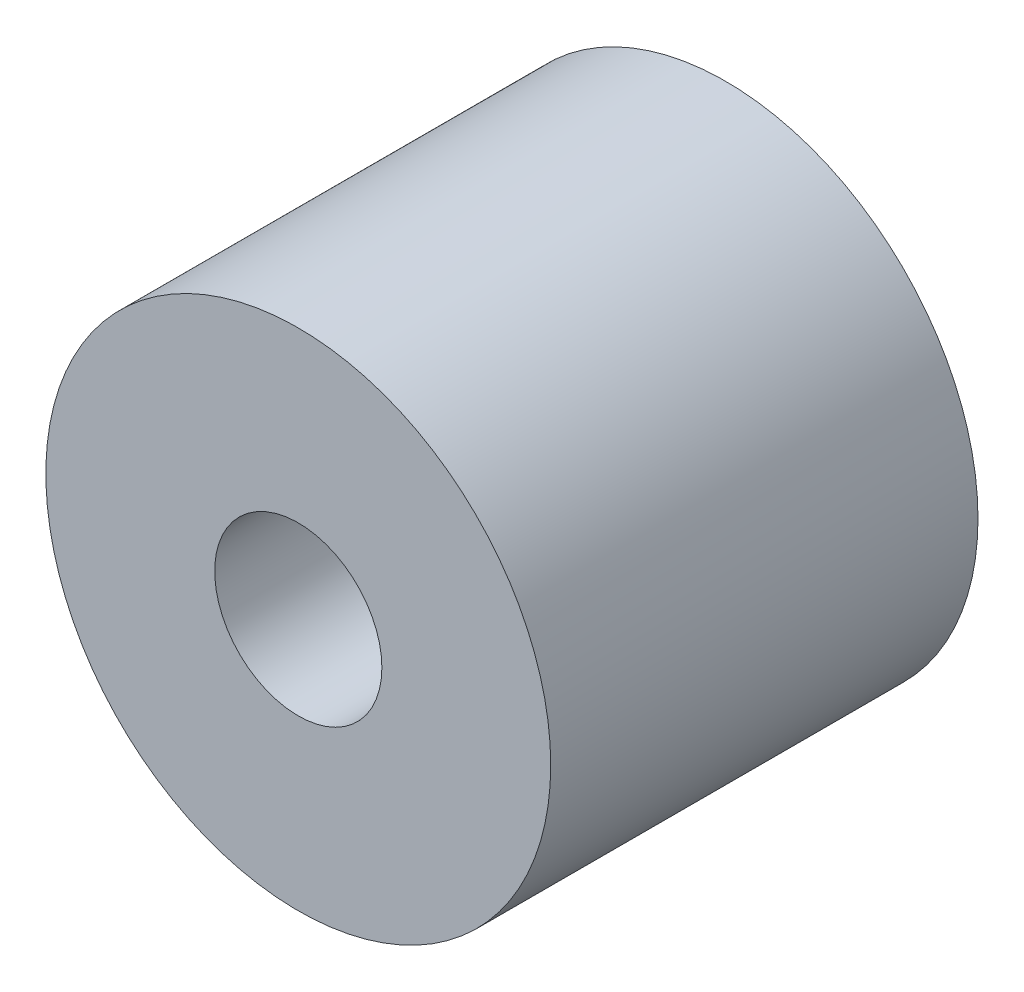
ISO-10303-21;
HEADER;
FILE_DESCRIPTION(('STEP AP214'),'2;1');
FILE_NAME('part.step','',(''),(''),'','','');
FILE_SCHEMA(('AUTOMOTIVE_DESIGN { 1 0 10303 214 1 1 1 1 }'));
ENDSEC;
DATA;
#1=APPLICATION_CONTEXT('core data for automotive mechanical design processes');
#2=APPLICATION_PROTOCOL_DEFINITION('international standard','automotive_design',2000,#1);
#3=PRODUCT_CONTEXT('',#1,'mechanical');
#4=PRODUCT('Part','Part','',(#3));
#5=PRODUCT_RELATED_PRODUCT_CATEGORY('part','',(#4));
#6=PRODUCT_DEFINITION_FORMATION('','',#4);
#7=PRODUCT_DEFINITION_CONTEXT('part definition',#1,'design');
#8=PRODUCT_DEFINITION('design','',#6,#7);
#9=PRODUCT_DEFINITION_SHAPE('','',#8);
#10=(LENGTH_UNIT() NAMED_UNIT(*) SI_UNIT(.MILLI.,.METRE.));
#11=(NAMED_UNIT(*) PLANE_ANGLE_UNIT() SI_UNIT($,.RADIAN.));
#12=(NAMED_UNIT(*) SI_UNIT($,.STERADIAN.) SOLID_ANGLE_UNIT());
#13=UNCERTAINTY_MEASURE_WITH_UNIT(LENGTH_MEASURE(1.E-05),#10,'distance_accuracy_value','');
#14=(GEOMETRIC_REPRESENTATION_CONTEXT(3) GLOBAL_UNCERTAINTY_ASSIGNED_CONTEXT((#13)) GLOBAL_UNIT_ASSIGNED_CONTEXT((#10,
#11,#12)) REPRESENTATION_CONTEXT('',''));
#15=CARTESIAN_POINT('',(0.,0.,0.));
#16=DIRECTION('',(0.,0.,1.));
#17=DIRECTION('',(1.,0.,0.));
#18=AXIS2_PLACEMENT_3D('',#15,#16,#17);
#19=CARTESIAN_POINT('',(0.,0.,199.898));
#20=DIRECTION('',(0.,0.,1.));
#21=DIRECTION('',(1.,0.,0.));
#22=AXIS2_PLACEMENT_3D('',#19,#20,#21);
#23=PLANE('',#22);
#24=CARTESIAN_POINT('',(0.,0.,199.898));
#25=DIRECTION('',(0.,0.,1.));
#26=DIRECTION('',(1.,0.,0.));
#27=AXIS2_PLACEMENT_3D('',#24,#25,#26);
#28=CIRCLE('',#27,118.11);
#29=CARTESIAN_POINT('',(118.11,0.,199.898));
#30=VERTEX_POINT('',#29);
#31=EDGE_CURVE('E10',#30,#30,#28,.T.);
#32=ORIENTED_EDGE('',*,*,#31,.T.);
#33=EDGE_LOOP('',(#32));
#34=FACE_BOUND('',#33,.T.);
#35=CARTESIAN_POINT('',(0.,0.,199.898));
#36=DIRECTION('',(0.,0.,1.));
#37=DIRECTION('',(1.,0.,0.));
#38=AXIS2_PLACEMENT_3D('',#35,#36,#37);
#39=CIRCLE('',#38,39.116);
#40=CARTESIAN_POINT('',(39.116,0.,199.898));
#41=VERTEX_POINT('',#40);
#42=EDGE_CURVE('E41',#41,#41,#39,.T.);
#43=ORIENTED_EDGE('',*,*,#42,.F.);
#44=EDGE_LOOP('',(#43));
#45=FACE_BOUND('',#44,.T.);
#46=ADVANCED_FACE('F30',(#34,#45),#23,.T.);
#47=CARTESIAN_POINT('',(0.,0.,0.));
#48=DIRECTION('',(0.,0.,1.));
#49=DIRECTION('',(1.,0.,0.));
#50=AXIS2_PLACEMENT_3D('',#47,#48,#49);
#51=PLANE('',#50);
#52=CARTESIAN_POINT('',(0.,0.,0.));
#53=DIRECTION('',(0.,0.,1.));
#54=DIRECTION('',(1.,0.,0.));
#55=AXIS2_PLACEMENT_3D('',#52,#53,#54);
#56=CIRCLE('',#55,118.11);
#57=CARTESIAN_POINT('',(118.11,0.,0.));
#58=VERTEX_POINT('',#57);
#59=EDGE_CURVE('E34',#58,#58,#56,.T.);
#60=ORIENTED_EDGE('',*,*,#59,.F.);
#61=EDGE_LOOP('',(#60));
#62=FACE_BOUND('',#61,.T.);
#63=CARTESIAN_POINT('',(0.,0.,0.));
#64=DIRECTION('',(0.,0.,1.));
#65=DIRECTION('',(1.,0.,0.));
#66=AXIS2_PLACEMENT_3D('',#63,#64,#65);
#67=CIRCLE('',#66,39.116);
#68=CARTESIAN_POINT('',(39.116,0.,0.));
#69=VERTEX_POINT('',#68);
#70=EDGE_CURVE('E43',#69,#69,#67,.T.);
#71=ORIENTED_EDGE('',*,*,#70,.T.);
#72=EDGE_LOOP('',(#71));
#73=FACE_BOUND('',#72,.T.);
#74=ADVANCED_FACE('F53',(#62,#73),#51,.F.);
#75=CARTESIAN_POINT('',(0.,0.,199.898));
#76=DIRECTION('',(0.,0.,-1.));
#77=DIRECTION('',(-1.,0.,0.));
#78=AXIS2_PLACEMENT_3D('',#75,#76,#77);
#79=CYLINDRICAL_SURFACE('',#78,118.11);
#80=ORIENTED_EDGE('',*,*,#31,.F.);
#81=EDGE_LOOP('',(#80));
#82=FACE_BOUND('',#81,.T.);
#83=ORIENTED_EDGE('',*,*,#59,.T.);
#84=EDGE_LOOP('',(#83));
#85=FACE_BOUND('',#84,.T.);
#86=ADVANCED_FACE('F32',(#82,#85),#79,.T.);
#87=CARTESIAN_POINT('',(0.,0.,199.898));
#88=DIRECTION('',(0.,0.,-1.));
#89=DIRECTION('',(-1.,0.,0.));
#90=AXIS2_PLACEMENT_3D('',#87,#88,#89);
#91=CYLINDRICAL_SURFACE('',#90,39.116);
#92=ORIENTED_EDGE('',*,*,#42,.T.);
#93=EDGE_LOOP('',(#92));
#94=FACE_BOUND('',#93,.T.);
#95=ORIENTED_EDGE('',*,*,#70,.F.);
#96=EDGE_LOOP('',(#95));
#97=FACE_BOUND('',#96,.T.);
#98=ADVANCED_FACE('F49',(#94,#97),#91,.F.);
#99=CLOSED_SHELL('',(#46,#74,#86,#98));
#100=MANIFOLD_SOLID_BREP('B2',#99);
#101=ADVANCED_BREP_SHAPE_REPRESENTATION('',(#18,#100),#14);
#102=SHAPE_DEFINITION_REPRESENTATION(#9,#101);
ENDSEC;
END-ISO-10303-21;
